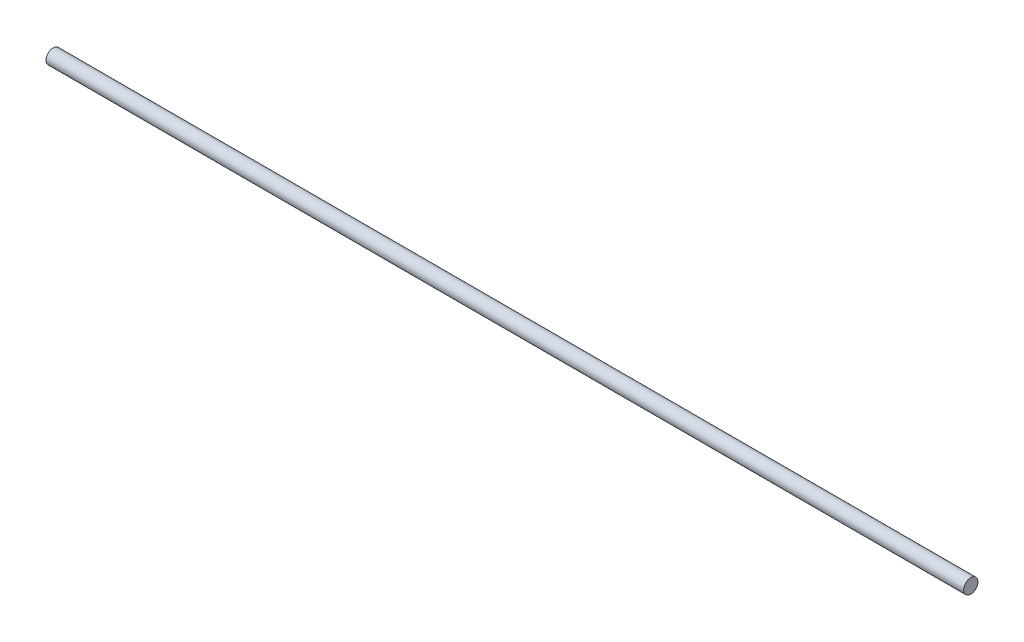
ISO-10303-21;
HEADER;
FILE_DESCRIPTION(('STEP AP214'),'2;1');
FILE_NAME('part.step','',(''),(''),'','','');
FILE_SCHEMA(('AUTOMOTIVE_DESIGN { 1 0 10303 214 1 1 1 1 }'));
ENDSEC;
DATA;
#1=APPLICATION_CONTEXT('core data for automotive mechanical design processes');
#2=APPLICATION_PROTOCOL_DEFINITION('international standard','automotive_design',2000,#1);
#3=PRODUCT_CONTEXT('',#1,'mechanical');
#4=PRODUCT('Part','Part','',(#3));
#5=PRODUCT_RELATED_PRODUCT_CATEGORY('part','',(#4));
#6=PRODUCT_DEFINITION_FORMATION('','',#4);
#7=PRODUCT_DEFINITION_CONTEXT('part definition',#1,'design');
#8=PRODUCT_DEFINITION('design','',#6,#7);
#9=PRODUCT_DEFINITION_SHAPE('','',#8);
#10=(LENGTH_UNIT() NAMED_UNIT(*) SI_UNIT(.MILLI.,.METRE.));
#11=(NAMED_UNIT(*) PLANE_ANGLE_UNIT() SI_UNIT($,.RADIAN.));
#12=(NAMED_UNIT(*) SI_UNIT($,.STERADIAN.) SOLID_ANGLE_UNIT());
#13=UNCERTAINTY_MEASURE_WITH_UNIT(LENGTH_MEASURE(1.E-05),#10,'distance_accuracy_value','');
#14=(GEOMETRIC_REPRESENTATION_CONTEXT(3) GLOBAL_UNCERTAINTY_ASSIGNED_CONTEXT((#13)) GLOBAL_UNIT_ASSIGNED_CONTEXT((#10,
#11,#12)) REPRESENTATION_CONTEXT('',''));
#15=CARTESIAN_POINT('',(0.,0.,0.));
#16=DIRECTION('',(0.,0.,1.));
#17=DIRECTION('',(1.,0.,0.));
#18=AXIS2_PLACEMENT_3D('',#15,#16,#17);
#19=CARTESIAN_POINT('',(203.2,0.,0.));
#20=DIRECTION('',(1.,0.,0.));
#21=DIRECTION('',(0.,0.,-1.));
#22=AXIS2_PLACEMENT_3D('',#19,#20,#21);
#23=PLANE('',#22);
#24=CARTESIAN_POINT('',(203.2,0.,0.));
#25=DIRECTION('',(1.,0.,0.));
#26=DIRECTION('',(0.,0.,-1.));
#27=AXIS2_PLACEMENT_3D('',#24,#25,#26);
#28=CIRCLE('',#27,3.175);
#29=CARTESIAN_POINT('',(203.2,0.,-3.175));
#30=VERTEX_POINT('',#29);
#31=EDGE_CURVE('E18',#30,#30,#28,.F.);
#32=ORIENTED_EDGE('',*,*,#31,.F.);
#33=EDGE_LOOP('',(#32));
#34=FACE_BOUND('',#33,.T.);
#35=ADVANCED_FACE('F15',(#34),#23,.T.);
#36=CARTESIAN_POINT('',(-203.2,0.,0.));
#37=DIRECTION('',(1.,0.,0.));
#38=DIRECTION('',(0.,0.,-1.));
#39=AXIS2_PLACEMENT_3D('',#36,#37,#38);
#40=PLANE('',#39);
#41=CARTESIAN_POINT('',(-203.2,0.,0.));
#42=DIRECTION('',(1.,0.,0.));
#43=DIRECTION('',(0.,0.,-1.));
#44=AXIS2_PLACEMENT_3D('',#41,#42,#43);
#45=CIRCLE('',#44,3.175);
#46=CARTESIAN_POINT('',(-203.2,0.,-3.175));
#47=VERTEX_POINT('',#46);
#48=EDGE_CURVE('E10',#47,#47,#45,.T.);
#49=ORIENTED_EDGE('',*,*,#48,.F.);
#50=EDGE_LOOP('',(#49));
#51=FACE_BOUND('',#50,.T.);
#52=ADVANCED_FACE('F30',(#51),#40,.F.);
#53=CARTESIAN_POINT('',(-203.2,0.,0.));
#54=DIRECTION('',(1.,0.,0.));
#55=DIRECTION('',(0.,0.,-1.));
#56=AXIS2_PLACEMENT_3D('',#53,#54,#55);
#57=CYLINDRICAL_SURFACE('',#56,3.175);
#58=ORIENTED_EDGE('',*,*,#31,.T.);
#59=EDGE_LOOP('',(#58));
#60=FACE_BOUND('',#59,.T.);
#61=ORIENTED_EDGE('',*,*,#48,.T.);
#62=EDGE_LOOP('',(#61));
#63=FACE_BOUND('',#62,.T.);
#64=ADVANCED_FACE('F27',(#60,#63),#57,.T.);
#65=CLOSED_SHELL('',(#35,#52,#64));
#66=MANIFOLD_SOLID_BREP('B1',#65);
#67=ADVANCED_BREP_SHAPE_REPRESENTATION('',(#18,#66),#14);
#68=SHAPE_DEFINITION_REPRESENTATION(#9,#67);
ENDSEC;
END-ISO-10303-21;
